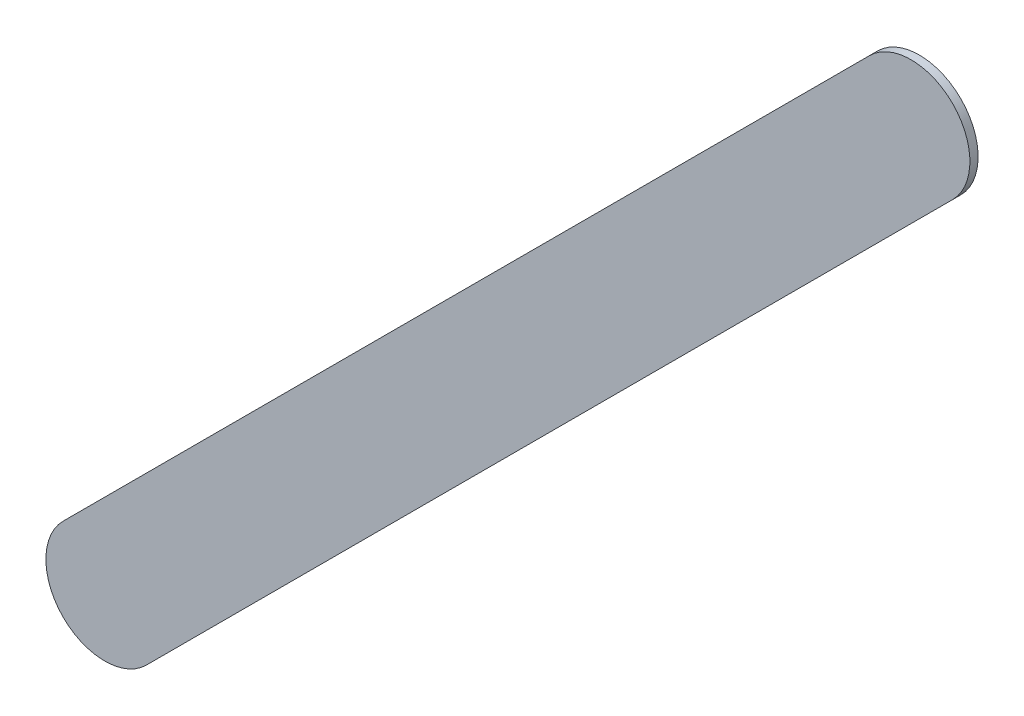
ISO-10303-21;
HEADER;
FILE_DESCRIPTION(('STEP AP214'),'2;1');
FILE_NAME('part.step','',(''),(''),'','','');
FILE_SCHEMA(('AUTOMOTIVE_DESIGN { 1 0 10303 214 1 1 1 1 }'));
ENDSEC;
DATA;
#1=APPLICATION_CONTEXT('core data for automotive mechanical design processes');
#2=APPLICATION_PROTOCOL_DEFINITION('international standard','automotive_design',2000,#1);
#3=PRODUCT_CONTEXT('',#1,'mechanical');
#4=PRODUCT('Part','Part','',(#3));
#5=PRODUCT_RELATED_PRODUCT_CATEGORY('part','',(#4));
#6=PRODUCT_DEFINITION_FORMATION('','',#4);
#7=PRODUCT_DEFINITION_CONTEXT('part definition',#1,'design');
#8=PRODUCT_DEFINITION('design','',#6,#7);
#9=PRODUCT_DEFINITION_SHAPE('','',#8);
#10=(LENGTH_UNIT() NAMED_UNIT(*) SI_UNIT(.MILLI.,.METRE.));
#11=(NAMED_UNIT(*) PLANE_ANGLE_UNIT() SI_UNIT($,.RADIAN.));
#12=(NAMED_UNIT(*) SI_UNIT($,.STERADIAN.) SOLID_ANGLE_UNIT());
#13=UNCERTAINTY_MEASURE_WITH_UNIT(LENGTH_MEASURE(1.E-05),#10,'distance_accuracy_value','');
#14=(GEOMETRIC_REPRESENTATION_CONTEXT(3) GLOBAL_UNCERTAINTY_ASSIGNED_CONTEXT((#13)) GLOBAL_UNIT_ASSIGNED_CONTEXT((#10,
#11,#12)) REPRESENTATION_CONTEXT('',''));
#15=CARTESIAN_POINT('',(0.,0.,0.));
#16=DIRECTION('',(0.,0.,1.));
#17=DIRECTION('',(1.,0.,0.));
#18=AXIS2_PLACEMENT_3D('',#15,#16,#17);
#19=CARTESIAN_POINT('',(141.527776,-109.269776,0.));
#20=DIRECTION('',(0.,0.,1.));
#21=DIRECTION('',(1.,0.,0.));
#22=AXIS2_PLACEMENT_3D('',#19,#20,#21);
#23=PLANE('',#22);
#24=DIRECTION('',(0.707106781186548,0.707106781186548,0.));
#25=VECTOR('',#24,1.);
#26=CARTESIAN_POINT('',(141.527776,-109.269776,0.));
#27=LINE('',#26,#25);
#28=CARTESIAN_POINT('',(141.527776,-109.269776,0.));
#29=VERTEX_POINT('',#28);
#30=CARTESIAN_POINT('',(144.956776,-105.840776,0.));
#31=VERTEX_POINT('',#30);
#32=EDGE_CURVE('E94',#29,#31,#27,.T.);
#33=ORIENTED_EDGE('',*,*,#32,.T.);
#34=CARTESIAN_POINT('',(144.7799995,-105.6639995,0.));
#35=DIRECTION('',(0.,0.,1.));
#36=DIRECTION('',(0.707106781186548,-0.707106781186548,0.));
#37=AXIS2_PLACEMENT_3D('',#34,#35,#36);
#38=CIRCLE('',#37,0.249999723809);
#39=CARTESIAN_POINT('',(144.603223,-105.487223,0.));
#40=VERTEX_POINT('',#39);
#41=EDGE_CURVE('E72',#31,#40,#38,.T.);
#42=ORIENTED_EDGE('',*,*,#41,.T.);
#43=DIRECTION('',(-0.707106781186548,-0.707106781186548,0.));
#44=VECTOR('',#43,1.);
#45=CARTESIAN_POINT('',(144.603223,-105.487223,0.));
#46=LINE('',#45,#44);
#47=CARTESIAN_POINT('',(141.174223,-108.916223,0.));
#48=VERTEX_POINT('',#47);
#49=EDGE_CURVE('E77',#40,#48,#46,.T.);
#50=ORIENTED_EDGE('',*,*,#49,.T.);
#51=CARTESIAN_POINT('',(141.3509995,-109.0929995,0.));
#52=DIRECTION('',(0.,0.,1.));
#53=DIRECTION('',(-0.707106781186548,0.707106781186548,0.));
#54=AXIS2_PLACEMENT_3D('',#51,#52,#53);
#55=CIRCLE('',#54,0.249999723809);
#56=EDGE_CURVE('E11',#48,#29,#55,.T.);
#57=ORIENTED_EDGE('',*,*,#56,.T.);
#58=EDGE_LOOP('',(#33,#42,#50,#57));
#59=FACE_BOUND('',#58,.T.);
#60=ADVANCED_FACE('F17',(#59),#23,.T.);
#61=CARTESIAN_POINT('',(141.527776,-109.269776,-0.035));
#62=DIRECTION('',(0.,0.,1.));
#63=DIRECTION('',(1.,0.,0.));
#64=AXIS2_PLACEMENT_3D('',#61,#62,#63);
#65=PLANE('',#64);
#66=CARTESIAN_POINT('',(141.3509995,-109.0929995,-0.035));
#67=DIRECTION('',(0.,0.,1.));
#68=DIRECTION('',(-0.707106781186548,0.707106781186548,0.));
#69=AXIS2_PLACEMENT_3D('',#66,#67,#68);
#70=CIRCLE('',#69,0.249999723809);
#71=CARTESIAN_POINT('',(141.174223,-108.916223,-0.035));
#72=VERTEX_POINT('',#71);
#73=CARTESIAN_POINT('',(141.527776,-109.269776,-0.035));
#74=VERTEX_POINT('',#73);
#75=EDGE_CURVE('E20',#72,#74,#70,.T.);
#76=ORIENTED_EDGE('',*,*,#75,.F.);
#77=DIRECTION('',(-0.707106781186548,-0.707106781186548,0.));
#78=VECTOR('',#77,1.);
#79=CARTESIAN_POINT('',(144.603223,-105.487223,-0.035));
#80=LINE('',#79,#78);
#81=CARTESIAN_POINT('',(144.603223,-105.487223,-0.035));
#82=VERTEX_POINT('',#81);
#83=EDGE_CURVE('E61',#82,#72,#80,.T.);
#84=ORIENTED_EDGE('',*,*,#83,.F.);
#85=CARTESIAN_POINT('',(144.7799995,-105.6639995,-0.035));
#86=DIRECTION('',(0.,0.,1.));
#87=DIRECTION('',(0.707106781186548,-0.707106781186548,0.));
#88=AXIS2_PLACEMENT_3D('',#85,#86,#87);
#89=CIRCLE('',#88,0.249999723809);
#90=CARTESIAN_POINT('',(144.956776,-105.840776,-0.035));
#91=VERTEX_POINT('',#90);
#92=EDGE_CURVE('E66',#91,#82,#89,.T.);
#93=ORIENTED_EDGE('',*,*,#92,.F.);
#94=DIRECTION('',(0.707106781186548,0.707106781186548,0.));
#95=VECTOR('',#94,1.);
#96=CARTESIAN_POINT('',(141.527776,-109.269776,-0.035));
#97=LINE('',#96,#95);
#98=EDGE_CURVE('E115',#74,#91,#97,.T.);
#99=ORIENTED_EDGE('',*,*,#98,.F.);
#100=EDGE_LOOP('',(#76,#84,#93,#99));
#101=FACE_BOUND('',#100,.T.);
#102=ADVANCED_FACE('F63',(#101),#65,.F.);
#103=CARTESIAN_POINT('',(141.3509995,-109.0929995,-0.035));
#104=DIRECTION('',(0.,0.,-1.));
#105=DIRECTION('',(-0.707106781186548,0.707106781186548,0.));
#106=AXIS2_PLACEMENT_3D('',#103,#104,#105);
#107=CYLINDRICAL_SURFACE('',#106,0.249999723809);
#108=ORIENTED_EDGE('',*,*,#75,.T.);
#109=DIRECTION('',(0.,0.,1.));
#110=VECTOR('',#109,1.);
#111=CARTESIAN_POINT('',(141.527776,-109.269776,-0.035));
#112=LINE('',#111,#110);
#113=EDGE_CURVE('E88',#74,#29,#112,.T.);
#114=ORIENTED_EDGE('',*,*,#113,.T.);
#115=ORIENTED_EDGE('',*,*,#56,.F.);
#116=DIRECTION('',(0.,0.,1.));
#117=VECTOR('',#116,1.);
#118=CARTESIAN_POINT('',(141.174223,-108.916223,-0.035));
#119=LINE('',#118,#117);
#120=EDGE_CURVE('E71',#72,#48,#119,.T.);
#121=ORIENTED_EDGE('',*,*,#120,.F.);
#122=EDGE_LOOP('',(#108,#114,#115,#121));
#123=FACE_BOUND('',#122,.T.);
#124=ADVANCED_FACE('F109',(#123),#107,.T.);
#125=CARTESIAN_POINT('',(144.603223,-105.487223,-0.035));
#126=DIRECTION('',(0.707106781186548,-0.707106781186548,0.));
#127=DIRECTION('',(0.,0.,-1.));
#128=AXIS2_PLACEMENT_3D('',#125,#126,#127);
#129=PLANE('',#128);
#130=ORIENTED_EDGE('',*,*,#83,.T.);
#131=ORIENTED_EDGE('',*,*,#120,.T.);
#132=ORIENTED_EDGE('',*,*,#49,.F.);
#133=DIRECTION('',(0.,0.,1.));
#134=VECTOR('',#133,1.);
#135=CARTESIAN_POINT('',(144.603223,-105.487223,-0.035));
#136=LINE('',#135,#134);
#137=EDGE_CURVE('E75',#82,#40,#136,.T.);
#138=ORIENTED_EDGE('',*,*,#137,.F.);
#139=EDGE_LOOP('',(#130,#131,#132,#138));
#140=FACE_BOUND('',#139,.T.);
#141=ADVANCED_FACE('F76',(#140),#129,.F.);
#142=CARTESIAN_POINT('',(144.7799995,-105.6639995,-0.035));
#143=DIRECTION('',(0.,0.,-1.));
#144=DIRECTION('',(0.707106781186548,-0.707106781186548,0.));
#145=AXIS2_PLACEMENT_3D('',#142,#143,#144);
#146=CYLINDRICAL_SURFACE('',#145,0.249999723809);
#147=ORIENTED_EDGE('',*,*,#92,.T.);
#148=ORIENTED_EDGE('',*,*,#137,.T.);
#149=ORIENTED_EDGE('',*,*,#41,.F.);
#150=DIRECTION('',(0.,0.,1.));
#151=VECTOR('',#150,1.);
#152=CARTESIAN_POINT('',(144.956776,-105.840776,-0.035));
#153=LINE('',#152,#151);
#154=EDGE_CURVE('E85',#91,#31,#153,.T.);
#155=ORIENTED_EDGE('',*,*,#154,.F.);
#156=EDGE_LOOP('',(#147,#148,#149,#155));
#157=FACE_BOUND('',#156,.T.);
#158=ADVANCED_FACE('F83',(#157),#146,.T.);
#159=CARTESIAN_POINT('',(141.527776,-109.269776,-0.035));
#160=DIRECTION('',(-0.707106781186548,0.707106781186548,0.));
#161=DIRECTION('',(0.,0.,1.));
#162=AXIS2_PLACEMENT_3D('',#159,#160,#161);
#163=PLANE('',#162);
#164=ORIENTED_EDGE('',*,*,#98,.T.);
#165=ORIENTED_EDGE('',*,*,#154,.T.);
#166=ORIENTED_EDGE('',*,*,#32,.F.);
#167=ORIENTED_EDGE('',*,*,#113,.F.);
#168=EDGE_LOOP('',(#164,#165,#166,#167));
#169=FACE_BOUND('',#168,.T.);
#170=ADVANCED_FACE('F114',(#169),#163,.F.);
#171=CLOSED_SHELL('',(#60,#102,#124,#141,#158,#170));
#172=MANIFOLD_SOLID_BREP('B1',#171);
#173=ADVANCED_BREP_SHAPE_REPRESENTATION('',(#18,#172),#14);
#174=SHAPE_DEFINITION_REPRESENTATION(#9,#173);
ENDSEC;
END-ISO-10303-21;
